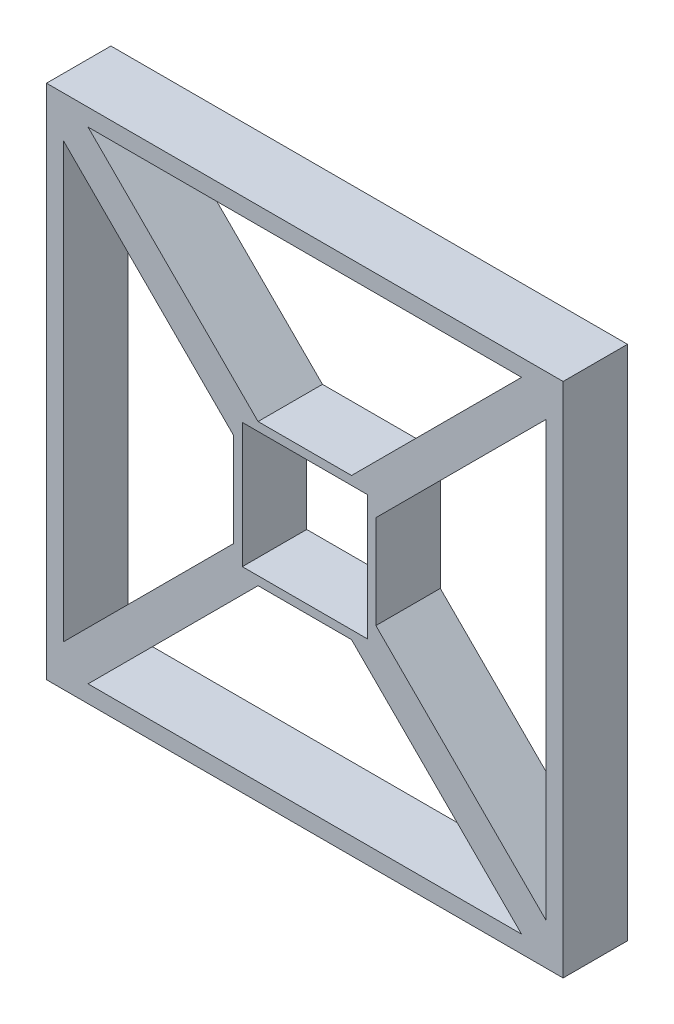
ISO-10303-21;
HEADER;
FILE_DESCRIPTION(('STEP AP214'),'2;1');
FILE_NAME('part.step','',(''),(''),'','','');
FILE_SCHEMA(('AUTOMOTIVE_DESIGN { 1 0 10303 214 1 1 1 1 }'));
ENDSEC;
DATA;
#1=APPLICATION_CONTEXT('core data for automotive mechanical design processes');
#2=APPLICATION_PROTOCOL_DEFINITION('international standard','automotive_design',2000,#1);
#3=PRODUCT_CONTEXT('',#1,'mechanical');
#4=PRODUCT('Part','Part','',(#3));
#5=PRODUCT_RELATED_PRODUCT_CATEGORY('part','',(#4));
#6=PRODUCT_DEFINITION_FORMATION('','',#4);
#7=PRODUCT_DEFINITION_CONTEXT('part definition',#1,'design');
#8=PRODUCT_DEFINITION('design','',#6,#7);
#9=PRODUCT_DEFINITION_SHAPE('','',#8);
#10=(LENGTH_UNIT() NAMED_UNIT(*) SI_UNIT(.MILLI.,.METRE.));
#11=(NAMED_UNIT(*) PLANE_ANGLE_UNIT() SI_UNIT($,.RADIAN.));
#12=(NAMED_UNIT(*) SI_UNIT($,.STERADIAN.) SOLID_ANGLE_UNIT());
#13=UNCERTAINTY_MEASURE_WITH_UNIT(LENGTH_MEASURE(1.E-05),#10,'distance_accuracy_value','');
#14=(GEOMETRIC_REPRESENTATION_CONTEXT(3) GLOBAL_UNCERTAINTY_ASSIGNED_CONTEXT((#13)) GLOBAL_UNIT_ASSIGNED_CONTEXT((#10,
#11,#12)) REPRESENTATION_CONTEXT('',''));
#15=CARTESIAN_POINT('',(0.,0.,0.));
#16=DIRECTION('',(0.,0.,1.));
#17=DIRECTION('',(1.,0.,0.));
#18=AXIS2_PLACEMENT_3D('',#15,#16,#17);
#19=CARTESIAN_POINT('',(0.,0.,748.));
#20=DIRECTION('',(0.,0.,-1.));
#21=DIRECTION('',(-1.,0.,0.));
#22=AXIS2_PLACEMENT_3D('',#19,#20,#21);
#23=PLANE('',#22);
#24=DIRECTION('',(0.707106781186548,-0.707106781186547,0.));
#25=VECTOR('',#24,1.);
#26=CARTESIAN_POINT('',(-2517.15728752538,2800.,748.));
#27=LINE('',#26,#25);
#28=CARTESIAN_POINT('',(-2517.15728752538,2800.,748.));
#29=VERTEX_POINT('',#28);
#30=CARTESIAN_POINT('',(-542.768436449289,825.611148923909,748.));
#31=VERTEX_POINT('',#30);
#32=EDGE_CURVE('E423',#29,#31,#27,.T.);
#33=ORIENTED_EDGE('',*,*,#32,.F.);
#34=DIRECTION('',(1.,0.,0.));
#35=VECTOR('',#34,1.);
#36=CARTESIAN_POINT('',(-2517.15728752538,2800.,748.));
#37=LINE('',#36,#35);
#38=CARTESIAN_POINT('',(2517.15728752538,2800.,748.));
#39=VERTEX_POINT('',#38);
#40=EDGE_CURVE('E418',#29,#39,#37,.T.);
#41=ORIENTED_EDGE('',*,*,#40,.T.);
#42=DIRECTION('',(0.707106781186547,0.707106781186547,0.));
#43=VECTOR('',#42,1.);
#44=CARTESIAN_POINT('',(542.768436449289,825.611148923909,748.));
#45=LINE('',#44,#43);
#46=CARTESIAN_POINT('',(542.768436449289,825.611148923909,748.));
#47=VERTEX_POINT('',#46);
#48=EDGE_CURVE('E410',#47,#39,#45,.T.);
#49=ORIENTED_EDGE('',*,*,#48,.F.);
#50=DIRECTION('',(1.,0.,0.));
#51=VECTOR('',#50,1.);
#52=CARTESIAN_POINT('',(-542.768436449289,825.611148923909,748.));
#53=LINE('',#52,#51);
#54=EDGE_CURVE('E417',#31,#47,#53,.T.);
#55=ORIENTED_EDGE('',*,*,#54,.F.);
#56=EDGE_LOOP('',(#33,#41,#49,#55));
#57=FACE_BOUND('',#56,.T.);
#58=DIRECTION('',(0.,-1.,0.));
#59=VECTOR('',#58,1.);
#60=CARTESIAN_POINT('',(-2800.,2517.15728752538,748.));
#61=LINE('',#60,#59);
#62=CARTESIAN_POINT('',(-2800.,2517.15728752538,748.));
#63=VERTEX_POINT('',#62);
#64=CARTESIAN_POINT('',(-2800.,-2517.15728752538,748.));
#65=VERTEX_POINT('',#64);
#66=EDGE_CURVE('E455',#63,#65,#61,.T.);
#67=ORIENTED_EDGE('',*,*,#66,.F.);
#68=DIRECTION('',(0.707106781186547,-0.707106781186548,0.));
#69=VECTOR('',#68,1.);
#70=CARTESIAN_POINT('',(-2800.,2517.15728752538,748.));
#71=LINE('',#70,#69);
#72=CARTESIAN_POINT('',(-825.611148923909,542.76843644929,748.));
#73=VERTEX_POINT('',#72);
#74=EDGE_CURVE('E445',#63,#73,#71,.T.);
#75=ORIENTED_EDGE('',*,*,#74,.T.);
#76=DIRECTION('',(0.,-1.,0.));
#77=VECTOR('',#76,1.);
#78=CARTESIAN_POINT('',(-825.611148923909,542.76843644929,748.));
#79=LINE('',#78,#77);
#80=CARTESIAN_POINT('',(-825.611148923908,-542.768436449287,748.));
#81=VERTEX_POINT('',#80);
#82=EDGE_CURVE('E448',#73,#81,#79,.T.);
#83=ORIENTED_EDGE('',*,*,#82,.T.);
#84=DIRECTION('',(0.707106781186547,0.707106781186548,0.));
#85=VECTOR('',#84,1.);
#86=CARTESIAN_POINT('',(-2800.,-2517.15728752538,748.));
#87=LINE('',#86,#85);
#88=EDGE_CURVE('E452',#65,#81,#87,.T.);
#89=ORIENTED_EDGE('',*,*,#88,.F.);
#90=EDGE_LOOP('',(#67,#75,#83,#89));
#91=FACE_BOUND('',#90,.T.);
#92=DIRECTION('',(1.,0.,0.));
#93=VECTOR('',#92,1.);
#94=CARTESIAN_POINT('',(-3000.,3000.,748.));
#95=LINE('',#94,#93);
#96=CARTESIAN_POINT('',(-3000.,3000.,748.));
#97=VERTEX_POINT('',#96);
#98=CARTESIAN_POINT('',(3000.,3000.,748.));
#99=VERTEX_POINT('',#98);
#100=EDGE_CURVE('E571',#97,#99,#95,.T.);
#101=ORIENTED_EDGE('',*,*,#100,.F.);
#102=DIRECTION('',(0.,-1.,0.));
#103=VECTOR('',#102,1.);
#104=CARTESIAN_POINT('',(-3000.,3000.,748.));
#105=LINE('',#104,#103);
#106=CARTESIAN_POINT('',(-3000.,-3000.,748.));
#107=VERTEX_POINT('',#106);
#108=EDGE_CURVE('E580',#97,#107,#105,.T.);
#109=ORIENTED_EDGE('',*,*,#108,.T.);
#110=DIRECTION('',(1.,0.,0.));
#111=VECTOR('',#110,1.);
#112=CARTESIAN_POINT('',(-3000.,-3000.,748.));
#113=LINE('',#112,#111);
#114=CARTESIAN_POINT('',(3000.,-3000.,748.));
#115=VERTEX_POINT('',#114);
#116=EDGE_CURVE('E578',#107,#115,#113,.T.);
#117=ORIENTED_EDGE('',*,*,#116,.T.);
#118=DIRECTION('',(0.,-1.,0.));
#119=VECTOR('',#118,1.);
#120=CARTESIAN_POINT('',(3000.,3000.,748.));
#121=LINE('',#120,#119);
#122=EDGE_CURVE('E574',#99,#115,#121,.T.);
#123=ORIENTED_EDGE('',*,*,#122,.F.);
#124=EDGE_LOOP('',(#101,#109,#117,#123));
#125=FACE_BOUND('',#124,.T.);
#126=DIRECTION('',(0.707106781186547,0.707106781186548,0.));
#127=VECTOR('',#126,1.);
#128=CARTESIAN_POINT('',(-2517.15728752538,-2800.,748.));
#129=LINE('',#128,#127);
#130=CARTESIAN_POINT('',(-2517.15728752538,-2800.,748.));
#131=VERTEX_POINT('',#130);
#132=CARTESIAN_POINT('',(-542.768436449289,-825.611148923907,748.));
#133=VERTEX_POINT('',#132);
#134=EDGE_CURVE('E549',#131,#133,#129,.T.);
#135=ORIENTED_EDGE('',*,*,#134,.T.);
#136=DIRECTION('',(1.,0.,0.));
#137=VECTOR('',#136,1.);
#138=CARTESIAN_POINT('',(-542.768436449289,-825.611148923907,748.));
#139=LINE('',#138,#137);
#140=CARTESIAN_POINT('',(542.768436449287,-825.611148923907,748.));
#141=VERTEX_POINT('',#140);
#142=EDGE_CURVE('E539',#133,#141,#139,.T.);
#143=ORIENTED_EDGE('',*,*,#142,.T.);
#144=DIRECTION('',(0.707106781186548,-0.707106781186547,0.));
#145=VECTOR('',#144,1.);
#146=CARTESIAN_POINT('',(542.768436449287,-825.611148923907,748.));
#147=LINE('',#146,#145);
#148=CARTESIAN_POINT('',(2517.15728752538,-2800.,748.));
#149=VERTEX_POINT('',#148);
#150=EDGE_CURVE('E542',#141,#149,#147,.T.);
#151=ORIENTED_EDGE('',*,*,#150,.T.);
#152=DIRECTION('',(1.,0.,0.));
#153=VECTOR('',#152,1.);
#154=CARTESIAN_POINT('',(-2517.15728752538,-2800.,748.));
#155=LINE('',#154,#153);
#156=EDGE_CURVE('E546',#131,#149,#155,.T.);
#157=ORIENTED_EDGE('',*,*,#156,.F.);
#158=EDGE_LOOP('',(#135,#143,#151,#157));
#159=FACE_BOUND('',#158,.T.);
#160=DIRECTION('',(0.,-1.,0.));
#161=VECTOR('',#160,1.);
#162=CARTESIAN_POINT('',(-725.611148923909,725.611148923909,748.));
#163=LINE('',#162,#161);
#164=CARTESIAN_POINT('',(-725.611148923909,725.611148923909,748.));
#165=VERTEX_POINT('',#164);
#166=CARTESIAN_POINT('',(-725.611148923909,-725.611148923907,748.));
#167=VERTEX_POINT('',#166);
#168=EDGE_CURVE('E518',#165,#167,#163,.T.);
#169=ORIENTED_EDGE('',*,*,#168,.F.);
#170=DIRECTION('',(1.,0.,0.));
#171=VECTOR('',#170,1.);
#172=CARTESIAN_POINT('',(-725.611148923909,725.611148923909,748.));
#173=LINE('',#172,#171);
#174=CARTESIAN_POINT('',(725.611148923909,725.611148923909,748.));
#175=VERTEX_POINT('',#174);
#176=EDGE_CURVE('E508',#165,#175,#173,.T.);
#177=ORIENTED_EDGE('',*,*,#176,.T.);
#178=DIRECTION('',(0.,-1.,0.));
#179=VECTOR('',#178,1.);
#180=CARTESIAN_POINT('',(725.611148923909,725.611148923909,748.));
#181=LINE('',#180,#179);
#182=CARTESIAN_POINT('',(725.611148923909,-725.611148923907,748.));
#183=VERTEX_POINT('',#182);
#184=EDGE_CURVE('E511',#175,#183,#181,.T.);
#185=ORIENTED_EDGE('',*,*,#184,.T.);
#186=DIRECTION('',(1.,0.,0.));
#187=VECTOR('',#186,1.);
#188=CARTESIAN_POINT('',(-725.611148923909,-725.611148923907,748.));
#189=LINE('',#188,#187);
#190=EDGE_CURVE('E515',#167,#183,#189,.T.);
#191=ORIENTED_EDGE('',*,*,#190,.F.);
#192=EDGE_LOOP('',(#169,#177,#185,#191));
#193=FACE_BOUND('',#192,.T.);
#194=DIRECTION('',(0.,-1.,0.));
#195=VECTOR('',#194,1.);
#196=CARTESIAN_POINT('',(825.611148923909,542.76843644929,748.));
#197=LINE('',#196,#195);
#198=CARTESIAN_POINT('',(825.611148923909,542.76843644929,748.));
#199=VERTEX_POINT('',#198);
#200=CARTESIAN_POINT('',(825.611148923908,-542.768436449288,748.));
#201=VERTEX_POINT('',#200);
#202=EDGE_CURVE('E476',#199,#201,#197,.T.);
#203=ORIENTED_EDGE('',*,*,#202,.F.);
#204=DIRECTION('',(0.707106781186548,0.707106781186547,0.));
#205=VECTOR('',#204,1.);
#206=CARTESIAN_POINT('',(825.611148923909,542.76843644929,748.));
#207=LINE('',#206,#205);
#208=CARTESIAN_POINT('',(2800.,2517.15728752538,748.));
#209=VERTEX_POINT('',#208);
#210=EDGE_CURVE('E484',#199,#209,#207,.T.);
#211=ORIENTED_EDGE('',*,*,#210,.T.);
#212=DIRECTION('',(0.,-1.,0.));
#213=VECTOR('',#212,1.);
#214=CARTESIAN_POINT('',(2800.,2517.15728752538,748.));
#215=LINE('',#214,#213);
#216=CARTESIAN_POINT('',(2800.,-2517.15728752538,748.));
#217=VERTEX_POINT('',#216);
#218=EDGE_CURVE('E481',#209,#217,#215,.T.);
#219=ORIENTED_EDGE('',*,*,#218,.T.);
#220=DIRECTION('',(0.707106781186548,-0.707106781186547,0.));
#221=VECTOR('',#220,1.);
#222=CARTESIAN_POINT('',(825.611148923908,-542.768436449288,748.));
#223=LINE('',#222,#221);
#224=EDGE_CURVE('E478',#201,#217,#223,.T.);
#225=ORIENTED_EDGE('',*,*,#224,.F.);
#226=EDGE_LOOP('',(#203,#211,#219,#225));
#227=FACE_BOUND('',#226,.T.);
#228=ADVANCED_FACE('F249',(#57,#91,#125,#159,#193,#227),#23,.F.);
#229=CARTESIAN_POINT('',(0.,0.,0.));
#230=DIRECTION('',(0.,0.,-1.));
#231=DIRECTION('',(-1.,0.,0.));
#232=AXIS2_PLACEMENT_3D('',#229,#230,#231);
#233=PLANE('',#232);
#234=DIRECTION('',(1.,0.,0.));
#235=VECTOR('',#234,1.);
#236=CARTESIAN_POINT('',(-2517.15728752538,2800.,0.));
#237=LINE('',#236,#235);
#238=CARTESIAN_POINT('',(-2517.15728752538,2800.,0.));
#239=VERTEX_POINT('',#238);
#240=CARTESIAN_POINT('',(2517.15728752538,2800.,0.));
#241=VERTEX_POINT('',#240);
#242=EDGE_CURVE('E274',#239,#241,#237,.T.);
#243=ORIENTED_EDGE('',*,*,#242,.F.);
#244=DIRECTION('',(0.707106781186548,-0.707106781186547,0.));
#245=VECTOR('',#244,1.);
#246=CARTESIAN_POINT('',(-2517.15728752538,2800.,0.));
#247=LINE('',#246,#245);
#248=CARTESIAN_POINT('',(-542.768436449289,825.611148923909,0.));
#249=VERTEX_POINT('',#248);
#250=EDGE_CURVE('E426',#239,#249,#247,.T.);
#251=ORIENTED_EDGE('',*,*,#250,.T.);
#252=DIRECTION('',(1.,0.,0.));
#253=VECTOR('',#252,1.);
#254=CARTESIAN_POINT('',(-542.768436449289,825.611148923909,0.));
#255=LINE('',#254,#253);
#256=CARTESIAN_POINT('',(542.768436449289,825.611148923909,0.));
#257=VERTEX_POINT('',#256);
#258=EDGE_CURVE('E429',#249,#257,#255,.T.);
#259=ORIENTED_EDGE('',*,*,#258,.T.);
#260=DIRECTION('',(0.707106781186547,0.707106781186547,0.));
#261=VECTOR('',#260,1.);
#262=CARTESIAN_POINT('',(542.768436449289,825.611148923909,0.));
#263=LINE('',#262,#261);
#264=EDGE_CURVE('E435',#257,#241,#263,.T.);
#265=ORIENTED_EDGE('',*,*,#264,.T.);
#266=EDGE_LOOP('',(#243,#251,#259,#265));
#267=FACE_BOUND('',#266,.T.);
#268=DIRECTION('',(0.707106781186547,-0.707106781186548,0.));
#269=VECTOR('',#268,1.);
#270=CARTESIAN_POINT('',(-2800.,2517.15728752538,0.));
#271=LINE('',#270,#269);
#272=CARTESIAN_POINT('',(-2800.,2517.15728752538,0.));
#273=VERTEX_POINT('',#272);
#274=CARTESIAN_POINT('',(-825.611148923909,542.76843644929,0.));
#275=VERTEX_POINT('',#274);
#276=EDGE_CURVE('E441',#273,#275,#271,.T.);
#277=ORIENTED_EDGE('',*,*,#276,.F.);
#278=DIRECTION('',(0.,-1.,0.));
#279=VECTOR('',#278,1.);
#280=CARTESIAN_POINT('',(-2800.,2517.15728752538,0.));
#281=LINE('',#280,#279);
#282=CARTESIAN_POINT('',(-2800.,-2517.15728752538,0.));
#283=VERTEX_POINT('',#282);
#284=EDGE_CURVE('E449',#273,#283,#281,.T.);
#285=ORIENTED_EDGE('',*,*,#284,.T.);
#286=DIRECTION('',(0.707106781186547,0.707106781186548,0.));
#287=VECTOR('',#286,1.);
#288=CARTESIAN_POINT('',(-2800.,-2517.15728752538,0.));
#289=LINE('',#288,#287);
#290=CARTESIAN_POINT('',(-825.611148923908,-542.768436449287,0.));
#291=VERTEX_POINT('',#290);
#292=EDGE_CURVE('E462',#283,#291,#289,.T.);
#293=ORIENTED_EDGE('',*,*,#292,.T.);
#294=DIRECTION('',(0.,-1.,0.));
#295=VECTOR('',#294,1.);
#296=CARTESIAN_POINT('',(-825.611148923909,542.76843644929,0.));
#297=LINE('',#296,#295);
#298=EDGE_CURVE('E459',#275,#291,#297,.T.);
#299=ORIENTED_EDGE('',*,*,#298,.F.);
#300=EDGE_LOOP('',(#277,#285,#293,#299));
#301=FACE_BOUND('',#300,.T.);
#302=DIRECTION('',(1.,0.,0.));
#303=VECTOR('',#302,1.);
#304=CARTESIAN_POINT('',(-725.611148923909,725.611148923909,0.));
#305=LINE('',#304,#303);
#306=CARTESIAN_POINT('',(-725.611148923909,725.611148923909,0.));
#307=VERTEX_POINT('',#306);
#308=CARTESIAN_POINT('',(725.611148923909,725.611148923909,0.));
#309=VERTEX_POINT('',#308);
#310=EDGE_CURVE('E507',#307,#309,#305,.T.);
#311=ORIENTED_EDGE('',*,*,#310,.F.);
#312=DIRECTION('',(0.,-1.,0.));
#313=VECTOR('',#312,1.);
#314=CARTESIAN_POINT('',(-725.611148923909,725.611148923909,0.));
#315=LINE('',#314,#313);
#316=CARTESIAN_POINT('',(-725.611148923909,-725.611148923907,0.));
#317=VERTEX_POINT('',#316);
#318=EDGE_CURVE('E512',#307,#317,#315,.T.);
#319=ORIENTED_EDGE('',*,*,#318,.T.);
#320=DIRECTION('',(1.,0.,0.));
#321=VECTOR('',#320,1.);
#322=CARTESIAN_POINT('',(-725.611148923909,-725.611148923907,0.));
#323=LINE('',#322,#321);
#324=CARTESIAN_POINT('',(725.611148923909,-725.611148923907,0.));
#325=VERTEX_POINT('',#324);
#326=EDGE_CURVE('E525',#317,#325,#323,.T.);
#327=ORIENTED_EDGE('',*,*,#326,.T.);
#328=DIRECTION('',(0.,-1.,0.));
#329=VECTOR('',#328,1.);
#330=CARTESIAN_POINT('',(725.611148923909,725.611148923909,0.));
#331=LINE('',#330,#329);
#332=EDGE_CURVE('E522',#309,#325,#331,.T.);
#333=ORIENTED_EDGE('',*,*,#332,.F.);
#334=EDGE_LOOP('',(#311,#319,#327,#333));
#335=FACE_BOUND('',#334,.T.);
#336=DIRECTION('',(1.,0.,0.));
#337=VECTOR('',#336,1.);
#338=CARTESIAN_POINT('',(-542.768436449289,-825.611148923907,0.));
#339=LINE('',#338,#337);
#340=CARTESIAN_POINT('',(-542.768436449289,-825.611148923907,0.));
#341=VERTEX_POINT('',#340);
#342=CARTESIAN_POINT('',(542.768436449287,-825.611148923907,0.));
#343=VERTEX_POINT('',#342);
#344=EDGE_CURVE('E532',#341,#343,#339,.T.);
#345=ORIENTED_EDGE('',*,*,#344,.F.);
#346=DIRECTION('',(0.707106781186547,0.707106781186548,0.));
#347=VECTOR('',#346,1.);
#348=CARTESIAN_POINT('',(-2517.15728752538,-2800.,0.));
#349=LINE('',#348,#347);
#350=CARTESIAN_POINT('',(-2517.15728752538,-2800.,0.));
#351=VERTEX_POINT('',#350);
#352=EDGE_CURVE('E543',#351,#341,#349,.T.);
#353=ORIENTED_EDGE('',*,*,#352,.F.);
#354=DIRECTION('',(1.,0.,0.));
#355=VECTOR('',#354,1.);
#356=CARTESIAN_POINT('',(-2517.15728752538,-2800.,0.));
#357=LINE('',#356,#355);
#358=CARTESIAN_POINT('',(2517.15728752538,-2800.,0.));
#359=VERTEX_POINT('',#358);
#360=EDGE_CURVE('E557',#351,#359,#357,.T.);
#361=ORIENTED_EDGE('',*,*,#360,.T.);
#362=DIRECTION('',(0.707106781186548,-0.707106781186547,0.));
#363=VECTOR('',#362,1.);
#364=CARTESIAN_POINT('',(542.768436449287,-825.611148923907,0.));
#365=LINE('',#364,#363);
#366=EDGE_CURVE('E554',#343,#359,#365,.T.);
#367=ORIENTED_EDGE('',*,*,#366,.F.);
#368=EDGE_LOOP('',(#345,#353,#361,#367));
#369=FACE_BOUND('',#368,.T.);
#370=DIRECTION('',(1.,0.,0.));
#371=VECTOR('',#370,1.);
#372=CARTESIAN_POINT('',(-3000.,3000.,0.));
#373=LINE('',#372,#371);
#374=CARTESIAN_POINT('',(-3000.,3000.,0.));
#375=VERTEX_POINT('',#374);
#376=CARTESIAN_POINT('',(3000.,3000.,0.));
#377=VERTEX_POINT('',#376);
#378=EDGE_CURVE('E564',#375,#377,#373,.T.);
#379=ORIENTED_EDGE('',*,*,#378,.T.);
#380=DIRECTION('',(0.,-1.,0.));
#381=VECTOR('',#380,1.);
#382=CARTESIAN_POINT('',(3000.,3000.,0.));
#383=LINE('',#382,#381);
#384=CARTESIAN_POINT('',(3000.,-3000.,0.));
#385=VERTEX_POINT('',#384);
#386=EDGE_CURVE('E584',#377,#385,#383,.T.);
#387=ORIENTED_EDGE('',*,*,#386,.T.);
#388=DIRECTION('',(1.,0.,0.));
#389=VECTOR('',#388,1.);
#390=CARTESIAN_POINT('',(-3000.,-3000.,0.));
#391=LINE('',#390,#389);
#392=CARTESIAN_POINT('',(-3000.,-3000.,0.));
#393=VERTEX_POINT('',#392);
#394=EDGE_CURVE('E587',#393,#385,#391,.T.);
#395=ORIENTED_EDGE('',*,*,#394,.F.);
#396=DIRECTION('',(0.,-1.,0.));
#397=VECTOR('',#396,1.);
#398=CARTESIAN_POINT('',(-3000.,3000.,0.));
#399=LINE('',#398,#397);
#400=EDGE_CURVE('E575',#375,#393,#399,.T.);
#401=ORIENTED_EDGE('',*,*,#400,.F.);
#402=EDGE_LOOP('',(#379,#387,#395,#401));
#403=FACE_BOUND('',#402,.T.);
#404=DIRECTION('',(0.707106781186548,0.707106781186547,0.));
#405=VECTOR('',#404,1.);
#406=CARTESIAN_POINT('',(825.611148923909,542.76843644929,0.));
#407=LINE('',#406,#405);
#408=CARTESIAN_POINT('',(825.611148923909,542.76843644929,0.));
#409=VERTEX_POINT('',#408);
#410=CARTESIAN_POINT('',(2800.,2517.15728752538,0.));
#411=VERTEX_POINT('',#410);
#412=EDGE_CURVE('E479',#409,#411,#407,.T.);
#413=ORIENTED_EDGE('',*,*,#412,.F.);
#414=DIRECTION('',(0.,-1.,0.));
#415=VECTOR('',#414,1.);
#416=CARTESIAN_POINT('',(825.611148923909,542.76843644929,0.));
#417=LINE('',#416,#415);
#418=CARTESIAN_POINT('',(825.611148923908,-542.768436449288,0.));
#419=VERTEX_POINT('',#418);
#420=EDGE_CURVE('E469',#409,#419,#417,.T.);
#421=ORIENTED_EDGE('',*,*,#420,.T.);
#422=DIRECTION('',(0.707106781186548,-0.707106781186547,0.));
#423=VECTOR('',#422,1.);
#424=CARTESIAN_POINT('',(825.611148923908,-542.768436449288,0.));
#425=LINE('',#424,#423);
#426=CARTESIAN_POINT('',(2800.,-2517.15728752538,0.));
#427=VERTEX_POINT('',#426);
#428=EDGE_CURVE('E490',#419,#427,#425,.T.);
#429=ORIENTED_EDGE('',*,*,#428,.T.);
#430=DIRECTION('',(0.,-1.,0.));
#431=VECTOR('',#430,1.);
#432=CARTESIAN_POINT('',(2800.,2517.15728752538,0.));
#433=LINE('',#432,#431);
#434=EDGE_CURVE('E493',#411,#427,#433,.T.);
#435=ORIENTED_EDGE('',*,*,#434,.F.);
#436=EDGE_LOOP('',(#413,#421,#429,#435));
#437=FACE_BOUND('',#436,.T.);
#438=ADVANCED_FACE('F604',(#267,#301,#335,#369,#403,#437),#233,.T.);
#439=CARTESIAN_POINT('',(-3000.,3000.,748.));
#440=DIRECTION('',(0.,1.,0.));
#441=DIRECTION('',(0.,0.,1.));
#442=AXIS2_PLACEMENT_3D('',#439,#440,#441);
#443=PLANE('',#442);
#444=ORIENTED_EDGE('',*,*,#378,.F.);
#445=DIRECTION('',(0.,0.,-1.));
#446=VECTOR('',#445,1.);
#447=CARTESIAN_POINT('',(-3000.,3000.,748.));
#448=LINE('',#447,#446);
#449=EDGE_CURVE('E12',#97,#375,#448,.T.);
#450=ORIENTED_EDGE('',*,*,#449,.F.);
#451=ORIENTED_EDGE('',*,*,#100,.T.);
#452=DIRECTION('',(0.,0.,-1.));
#453=VECTOR('',#452,1.);
#454=CARTESIAN_POINT('',(3000.,3000.,748.));
#455=LINE('',#454,#453);
#456=EDGE_CURVE('E253',#99,#377,#455,.T.);
#457=ORIENTED_EDGE('',*,*,#456,.T.);
#458=EDGE_LOOP('',(#444,#450,#451,#457));
#459=FACE_BOUND('',#458,.T.);
#460=ADVANCED_FACE('F251',(#459),#443,.T.);
#461=CARTESIAN_POINT('',(-3000.,3000.,748.));
#462=DIRECTION('',(1.,0.,0.));
#463=DIRECTION('',(0.,1.,0.));
#464=AXIS2_PLACEMENT_3D('',#461,#462,#463);
#465=PLANE('',#464);
#466=ORIENTED_EDGE('',*,*,#400,.T.);
#467=DIRECTION('',(0.,0.,-1.));
#468=VECTOR('',#467,1.);
#469=CARTESIAN_POINT('',(-3000.,-3000.,748.));
#470=LINE('',#469,#468);
#471=EDGE_CURVE('E258',#107,#393,#470,.T.);
#472=ORIENTED_EDGE('',*,*,#471,.F.);
#473=ORIENTED_EDGE('',*,*,#108,.F.);
#474=ORIENTED_EDGE('',*,*,#449,.T.);
#475=EDGE_LOOP('',(#466,#472,#473,#474));
#476=FACE_BOUND('',#475,.T.);
#477=ADVANCED_FACE('F608',(#476),#465,.F.);
#478=CARTESIAN_POINT('',(-3000.,-3000.,748.));
#479=DIRECTION('',(0.,1.,0.));
#480=DIRECTION('',(0.,0.,1.));
#481=AXIS2_PLACEMENT_3D('',#478,#479,#480);
#482=PLANE('',#481);
#483=ORIENTED_EDGE('',*,*,#394,.T.);
#484=DIRECTION('',(0.,0.,-1.));
#485=VECTOR('',#484,1.);
#486=CARTESIAN_POINT('',(3000.,-3000.,748.));
#487=LINE('',#486,#485);
#488=EDGE_CURVE('E592',#115,#385,#487,.T.);
#489=ORIENTED_EDGE('',*,*,#488,.F.);
#490=ORIENTED_EDGE('',*,*,#116,.F.);
#491=ORIENTED_EDGE('',*,*,#471,.T.);
#492=EDGE_LOOP('',(#483,#489,#490,#491));
#493=FACE_BOUND('',#492,.T.);
#494=ADVANCED_FACE('F612',(#493),#482,.F.);
#495=CARTESIAN_POINT('',(3000.,3000.,748.));
#496=DIRECTION('',(1.,0.,0.));
#497=DIRECTION('',(0.,1.,0.));
#498=AXIS2_PLACEMENT_3D('',#495,#496,#497);
#499=PLANE('',#498);
#500=ORIENTED_EDGE('',*,*,#386,.F.);
#501=ORIENTED_EDGE('',*,*,#456,.F.);
#502=ORIENTED_EDGE('',*,*,#122,.T.);
#503=ORIENTED_EDGE('',*,*,#488,.T.);
#504=EDGE_LOOP('',(#500,#501,#502,#503));
#505=FACE_BOUND('',#504,.T.);
#506=ADVANCED_FACE('F600',(#505),#499,.T.);
#507=CARTESIAN_POINT('',(-542.768436449289,-825.611148923907,748.));
#508=DIRECTION('',(0.,1.,0.));
#509=DIRECTION('',(-1.,0.,0.));
#510=AXIS2_PLACEMENT_3D('',#507,#508,#509);
#511=PLANE('',#510);
#512=ORIENTED_EDGE('',*,*,#344,.T.);
#513=DIRECTION('',(0.,0.,-1.));
#514=VECTOR('',#513,1.);
#515=CARTESIAN_POINT('',(542.768436449287,-825.611148923907,748.));
#516=LINE('',#515,#514);
#517=EDGE_CURVE('E552',#141,#343,#516,.T.);
#518=ORIENTED_EDGE('',*,*,#517,.F.);
#519=ORIENTED_EDGE('',*,*,#142,.F.);
#520=DIRECTION('',(0.,0.,-1.));
#521=VECTOR('',#520,1.);
#522=CARTESIAN_POINT('',(-542.768436449289,-825.611148923907,748.));
#523=LINE('',#522,#521);
#524=EDGE_CURVE('E562',#133,#341,#523,.T.);
#525=ORIENTED_EDGE('',*,*,#524,.T.);
#526=EDGE_LOOP('',(#512,#518,#519,#525));
#527=FACE_BOUND('',#526,.T.);
#528=ADVANCED_FACE('F673',(#527),#511,.F.);
#529=CARTESIAN_POINT('',(-2517.15728752538,-2800.,748.));
#530=DIRECTION('',(-0.707106781186548,0.707106781186547,0.));
#531=DIRECTION('',(-0.707106781186547,-0.707106781186548,0.));
#532=AXIS2_PLACEMENT_3D('',#529,#530,#531);
#533=PLANE('',#532);
#534=ORIENTED_EDGE('',*,*,#352,.T.);
#535=ORIENTED_EDGE('',*,*,#524,.F.);
#536=ORIENTED_EDGE('',*,*,#134,.F.);
#537=DIRECTION('',(0.,0.,-1.));
#538=VECTOR('',#537,1.);
#539=CARTESIAN_POINT('',(-2517.15728752538,-2800.,748.));
#540=LINE('',#539,#538);
#541=EDGE_CURVE('E565',#131,#351,#540,.T.);
#542=ORIENTED_EDGE('',*,*,#541,.T.);
#543=EDGE_LOOP('',(#534,#535,#536,#542));
#544=FACE_BOUND('',#543,.T.);
#545=ADVANCED_FACE('F669',(#544),#533,.F.);
#546=CARTESIAN_POINT('',(-2517.15728752538,-2800.,748.));
#547=DIRECTION('',(0.,1.,0.));
#548=DIRECTION('',(0.,0.,1.));
#549=AXIS2_PLACEMENT_3D('',#546,#547,#548);
#550=PLANE('',#549);
#551=ORIENTED_EDGE('',*,*,#360,.F.);
#552=ORIENTED_EDGE('',*,*,#541,.F.);
#553=ORIENTED_EDGE('',*,*,#156,.T.);
#554=DIRECTION('',(0.,0.,-1.));
#555=VECTOR('',#554,1.);
#556=CARTESIAN_POINT('',(2517.15728752538,-2800.,748.));
#557=LINE('',#556,#555);
#558=EDGE_CURVE('E567',#149,#359,#557,.T.);
#559=ORIENTED_EDGE('',*,*,#558,.T.);
#560=EDGE_LOOP('',(#551,#552,#553,#559));
#561=FACE_BOUND('',#560,.T.);
#562=ADVANCED_FACE('F672',(#561),#550,.T.);
#563=CARTESIAN_POINT('',(542.768436449287,-825.611148923907,748.));
#564=DIRECTION('',(0.707106781186548,0.707106781186548,0.));
#565=DIRECTION('',(-0.707106781186548,0.707106781186547,0.));
#566=AXIS2_PLACEMENT_3D('',#563,#564,#565);
#567=PLANE('',#566);
#568=ORIENTED_EDGE('',*,*,#366,.T.);
#569=ORIENTED_EDGE('',*,*,#558,.F.);
#570=ORIENTED_EDGE('',*,*,#150,.F.);
#571=ORIENTED_EDGE('',*,*,#517,.T.);
#572=EDGE_LOOP('',(#568,#569,#570,#571));
#573=FACE_BOUND('',#572,.T.);
#574=ADVANCED_FACE('F667',(#573),#567,.F.);
#575=CARTESIAN_POINT('',(-725.611148923909,725.611148923909,748.));
#576=DIRECTION('',(0.,1.,0.));
#577=DIRECTION('',(0.,0.,1.));
#578=AXIS2_PLACEMENT_3D('',#575,#576,#577);
#579=PLANE('',#578);
#580=ORIENTED_EDGE('',*,*,#310,.T.);
#581=DIRECTION('',(0.,0.,-1.));
#582=VECTOR('',#581,1.);
#583=CARTESIAN_POINT('',(725.611148923909,725.611148923909,748.));
#584=LINE('',#583,#582);
#585=EDGE_CURVE('E520',#175,#309,#584,.T.);
#586=ORIENTED_EDGE('',*,*,#585,.F.);
#587=ORIENTED_EDGE('',*,*,#176,.F.);
#588=DIRECTION('',(0.,0.,-1.));
#589=VECTOR('',#588,1.);
#590=CARTESIAN_POINT('',(-725.611148923909,725.611148923909,748.));
#591=LINE('',#590,#589);
#592=EDGE_CURVE('E530',#165,#307,#591,.T.);
#593=ORIENTED_EDGE('',*,*,#592,.T.);
#594=EDGE_LOOP('',(#580,#586,#587,#593));
#595=FACE_BOUND('',#594,.T.);
#596=ADVANCED_FACE('F657',(#595),#579,.F.);
#597=CARTESIAN_POINT('',(-725.611148923909,725.611148923909,748.));
#598=DIRECTION('',(1.,0.,0.));
#599=DIRECTION('',(0.,0.,-1.));
#600=AXIS2_PLACEMENT_3D('',#597,#598,#599);
#601=PLANE('',#600);
#602=ORIENTED_EDGE('',*,*,#318,.F.);
#603=ORIENTED_EDGE('',*,*,#592,.F.);
#604=ORIENTED_EDGE('',*,*,#168,.T.);
#605=DIRECTION('',(0.,0.,-1.));
#606=VECTOR('',#605,1.);
#607=CARTESIAN_POINT('',(-725.611148923909,-725.611148923907,748.));
#608=LINE('',#607,#606);
#609=EDGE_CURVE('E533',#167,#317,#608,.T.);
#610=ORIENTED_EDGE('',*,*,#609,.T.);
#611=EDGE_LOOP('',(#602,#603,#604,#610));
#612=FACE_BOUND('',#611,.T.);
#613=ADVANCED_FACE('F653',(#612),#601,.T.);
#614=CARTESIAN_POINT('',(-725.611148923909,-725.611148923907,748.));
#615=DIRECTION('',(0.,1.,0.));
#616=DIRECTION('',(0.,0.,1.));
#617=AXIS2_PLACEMENT_3D('',#614,#615,#616);
#618=PLANE('',#617);
#619=ORIENTED_EDGE('',*,*,#326,.F.);
#620=ORIENTED_EDGE('',*,*,#609,.F.);
#621=ORIENTED_EDGE('',*,*,#190,.T.);
#622=DIRECTION('',(0.,0.,-1.));
#623=VECTOR('',#622,1.);
#624=CARTESIAN_POINT('',(725.611148923909,-725.611148923907,748.));
#625=LINE('',#624,#623);
#626=EDGE_CURVE('E535',#183,#325,#625,.T.);
#627=ORIENTED_EDGE('',*,*,#626,.T.);
#628=EDGE_LOOP('',(#619,#620,#621,#627));
#629=FACE_BOUND('',#628,.T.);
#630=ADVANCED_FACE('F656',(#629),#618,.T.);
#631=CARTESIAN_POINT('',(725.611148923909,725.611148923909,748.));
#632=DIRECTION('',(1.,0.,0.));
#633=DIRECTION('',(0.,0.,-1.));
#634=AXIS2_PLACEMENT_3D('',#631,#632,#633);
#635=PLANE('',#634);
#636=ORIENTED_EDGE('',*,*,#332,.T.);
#637=ORIENTED_EDGE('',*,*,#626,.F.);
#638=ORIENTED_EDGE('',*,*,#184,.F.);
#639=ORIENTED_EDGE('',*,*,#585,.T.);
#640=EDGE_LOOP('',(#636,#637,#638,#639));
#641=FACE_BOUND('',#640,.T.);
#642=ADVANCED_FACE('F652',(#641),#635,.F.);
#643=CARTESIAN_POINT('',(825.611148923909,542.76843644929,748.));
#644=DIRECTION('',(1.,0.,0.));
#645=DIRECTION('',(0.,1.,0.));
#646=AXIS2_PLACEMENT_3D('',#643,#644,#645);
#647=PLANE('',#646);
#648=ORIENTED_EDGE('',*,*,#420,.F.);
#649=DIRECTION('',(0.,0.,-1.));
#650=VECTOR('',#649,1.);
#651=CARTESIAN_POINT('',(825.611148923909,542.76843644929,748.));
#652=LINE('',#651,#650);
#653=EDGE_CURVE('E487',#199,#409,#652,.T.);
#654=ORIENTED_EDGE('',*,*,#653,.F.);
#655=ORIENTED_EDGE('',*,*,#202,.T.);
#656=DIRECTION('',(0.,0.,-1.));
#657=VECTOR('',#656,1.);
#658=CARTESIAN_POINT('',(825.611148923908,-542.768436449288,748.));
#659=LINE('',#658,#657);
#660=EDGE_CURVE('E504',#201,#419,#659,.T.);
#661=ORIENTED_EDGE('',*,*,#660,.T.);
#662=EDGE_LOOP('',(#648,#654,#655,#661));
#663=FACE_BOUND('',#662,.T.);
#664=ADVANCED_FACE('F628',(#663),#647,.T.);
#665=CARTESIAN_POINT('',(825.611148923908,-542.768436449288,748.));
#666=DIRECTION('',(0.707106781186548,0.707106781186548,0.));
#667=DIRECTION('',(-0.707106781186548,0.707106781186547,0.));
#668=AXIS2_PLACEMENT_3D('',#665,#666,#667);
#669=PLANE('',#668);
#670=ORIENTED_EDGE('',*,*,#428,.F.);
#671=ORIENTED_EDGE('',*,*,#660,.F.);
#672=ORIENTED_EDGE('',*,*,#224,.T.);
#673=DIRECTION('',(0.,0.,-1.));
#674=VECTOR('',#673,1.);
#675=CARTESIAN_POINT('',(2800.,-2517.15728752538,748.));
#676=LINE('',#675,#674);
#677=EDGE_CURVE('E502',#217,#427,#676,.T.);
#678=ORIENTED_EDGE('',*,*,#677,.T.);
#679=EDGE_LOOP('',(#670,#671,#672,#678));
#680=FACE_BOUND('',#679,.T.);
#681=ADVANCED_FACE('F630',(#680),#669,.T.);
#682=CARTESIAN_POINT('',(2800.,2517.15728752538,748.));
#683=DIRECTION('',(1.,0.,0.));
#684=DIRECTION('',(0.,0.,-1.));
#685=AXIS2_PLACEMENT_3D('',#682,#683,#684);
#686=PLANE('',#685);
#687=ORIENTED_EDGE('',*,*,#434,.T.);
#688=ORIENTED_EDGE('',*,*,#677,.F.);
#689=ORIENTED_EDGE('',*,*,#218,.F.);
#690=DIRECTION('',(0.,0.,-1.));
#691=VECTOR('',#690,1.);
#692=CARTESIAN_POINT('',(2800.,2517.15728752538,748.));
#693=LINE('',#692,#691);
#694=EDGE_CURVE('E500',#209,#411,#693,.T.);
#695=ORIENTED_EDGE('',*,*,#694,.T.);
#696=EDGE_LOOP('',(#687,#688,#689,#695));
#697=FACE_BOUND('',#696,.T.);
#698=ADVANCED_FACE('F638',(#697),#686,.F.);
#699=CARTESIAN_POINT('',(825.611148923909,542.76843644929,748.));
#700=DIRECTION('',(-0.707106781186548,0.707106781186548,0.));
#701=DIRECTION('',(-0.707106781186548,-0.707106781186547,0.));
#702=AXIS2_PLACEMENT_3D('',#699,#700,#701);
#703=PLANE('',#702);
#704=ORIENTED_EDGE('',*,*,#412,.T.);
#705=ORIENTED_EDGE('',*,*,#694,.F.);
#706=ORIENTED_EDGE('',*,*,#210,.F.);
#707=ORIENTED_EDGE('',*,*,#653,.T.);
#708=EDGE_LOOP('',(#704,#705,#706,#707));
#709=FACE_BOUND('',#708,.T.);
#710=ADVANCED_FACE('F635',(#709),#703,.F.);
#711=CARTESIAN_POINT('',(-2800.,2517.15728752538,748.));
#712=DIRECTION('',(0.707106781186548,0.707106781186548,0.));
#713=DIRECTION('',(-0.707106781186547,0.707106781186548,0.));
#714=AXIS2_PLACEMENT_3D('',#711,#712,#713);
#715=PLANE('',#714);
#716=ORIENTED_EDGE('',*,*,#276,.T.);
#717=DIRECTION('',(0.,0.,-1.));
#718=VECTOR('',#717,1.);
#719=CARTESIAN_POINT('',(-825.611148923909,542.76843644929,748.));
#720=LINE('',#719,#718);
#721=EDGE_CURVE('E457',#73,#275,#720,.T.);
#722=ORIENTED_EDGE('',*,*,#721,.F.);
#723=ORIENTED_EDGE('',*,*,#74,.F.);
#724=DIRECTION('',(0.,0.,-1.));
#725=VECTOR('',#724,1.);
#726=CARTESIAN_POINT('',(-2800.,2517.15728752538,748.));
#727=LINE('',#726,#725);
#728=EDGE_CURVE('E467',#63,#273,#727,.T.);
#729=ORIENTED_EDGE('',*,*,#728,.T.);
#730=EDGE_LOOP('',(#716,#722,#723,#729));
#731=FACE_BOUND('',#730,.T.);
#732=ADVANCED_FACE('F645',(#731),#715,.F.);
#733=CARTESIAN_POINT('',(-2800.,2517.15728752538,748.));
#734=DIRECTION('',(1.,0.,0.));
#735=DIRECTION('',(0.,0.,-1.));
#736=AXIS2_PLACEMENT_3D('',#733,#734,#735);
#737=PLANE('',#736);
#738=ORIENTED_EDGE('',*,*,#284,.F.);
#739=ORIENTED_EDGE('',*,*,#728,.F.);
#740=ORIENTED_EDGE('',*,*,#66,.T.);
#741=DIRECTION('',(0.,0.,-1.));
#742=VECTOR('',#741,1.);
#743=CARTESIAN_POINT('',(-2800.,-2517.15728752538,748.));
#744=LINE('',#743,#742);
#745=EDGE_CURVE('E470',#65,#283,#744,.T.);
#746=ORIENTED_EDGE('',*,*,#745,.T.);
#747=EDGE_LOOP('',(#738,#739,#740,#746));
#748=FACE_BOUND('',#747,.T.);
#749=ADVANCED_FACE('F754',(#748),#737,.T.);
#750=CARTESIAN_POINT('',(-2800.,-2517.15728752538,748.));
#751=DIRECTION('',(-0.707106781186548,0.707106781186548,0.));
#752=DIRECTION('',(-0.707106781186547,-0.707106781186548,0.));
#753=AXIS2_PLACEMENT_3D('',#750,#751,#752);
#754=PLANE('',#753);
#755=ORIENTED_EDGE('',*,*,#292,.F.);
#756=ORIENTED_EDGE('',*,*,#745,.F.);
#757=ORIENTED_EDGE('',*,*,#88,.T.);
#758=DIRECTION('',(0.,0.,-1.));
#759=VECTOR('',#758,1.);
#760=CARTESIAN_POINT('',(-825.611148923908,-542.768436449287,748.));
#761=LINE('',#760,#759);
#762=EDGE_CURVE('E472',#81,#291,#761,.T.);
#763=ORIENTED_EDGE('',*,*,#762,.T.);
#764=EDGE_LOOP('',(#755,#756,#757,#763));
#765=FACE_BOUND('',#764,.T.);
#766=ADVANCED_FACE('F763',(#765),#754,.T.);
#767=CARTESIAN_POINT('',(-825.611148923909,542.76843644929,748.));
#768=DIRECTION('',(1.,0.,0.));
#769=DIRECTION('',(0.,1.,0.));
#770=AXIS2_PLACEMENT_3D('',#767,#768,#769);
#771=PLANE('',#770);
#772=ORIENTED_EDGE('',*,*,#298,.T.);
#773=ORIENTED_EDGE('',*,*,#762,.F.);
#774=ORIENTED_EDGE('',*,*,#82,.F.);
#775=ORIENTED_EDGE('',*,*,#721,.T.);
#776=EDGE_LOOP('',(#772,#773,#774,#775));
#777=FACE_BOUND('',#776,.T.);
#778=ADVANCED_FACE('F773',(#777),#771,.F.);
#779=CARTESIAN_POINT('',(-2517.15728752538,2800.,748.));
#780=DIRECTION('',(0.,1.,0.));
#781=DIRECTION('',(-1.,0.,0.));
#782=AXIS2_PLACEMENT_3D('',#779,#780,#781);
#783=PLANE('',#782);
#784=ORIENTED_EDGE('',*,*,#242,.T.);
#785=DIRECTION('',(0.,0.,-1.));
#786=VECTOR('',#785,1.);
#787=CARTESIAN_POINT('',(2517.15728752538,2800.,748.));
#788=LINE('',#787,#786);
#789=EDGE_CURVE('E412',#39,#241,#788,.T.);
#790=ORIENTED_EDGE('',*,*,#789,.F.);
#791=ORIENTED_EDGE('',*,*,#40,.F.);
#792=DIRECTION('',(0.,0.,-1.));
#793=VECTOR('',#792,1.);
#794=CARTESIAN_POINT('',(-2517.15728752538,2800.,748.));
#795=LINE('',#794,#793);
#796=EDGE_CURVE('E439',#29,#239,#795,.T.);
#797=ORIENTED_EDGE('',*,*,#796,.T.);
#798=EDGE_LOOP('',(#784,#790,#791,#797));
#799=FACE_BOUND('',#798,.T.);
#800=ADVANCED_FACE('F421',(#799),#783,.F.);
#801=CARTESIAN_POINT('',(-2517.15728752538,2800.,748.));
#802=DIRECTION('',(0.707106781186548,0.707106781186548,0.));
#803=DIRECTION('',(-0.707106781186548,0.707106781186547,0.));
#804=AXIS2_PLACEMENT_3D('',#801,#802,#803);
#805=PLANE('',#804);
#806=ORIENTED_EDGE('',*,*,#250,.F.);
#807=ORIENTED_EDGE('',*,*,#796,.F.);
#808=ORIENTED_EDGE('',*,*,#32,.T.);
#809=DIRECTION('',(0.,0.,-1.));
#810=VECTOR('',#809,1.);
#811=CARTESIAN_POINT('',(-542.768436449289,825.611148923909,748.));
#812=LINE('',#811,#810);
#813=EDGE_CURVE('E442',#31,#249,#812,.T.);
#814=ORIENTED_EDGE('',*,*,#813,.T.);
#815=EDGE_LOOP('',(#806,#807,#808,#814));
#816=FACE_BOUND('',#815,.T.);
#817=ADVANCED_FACE('F792',(#816),#805,.T.);
#818=CARTESIAN_POINT('',(-542.768436449289,825.611148923909,748.));
#819=DIRECTION('',(0.,1.,0.));
#820=DIRECTION('',(-1.,0.,0.));
#821=AXIS2_PLACEMENT_3D('',#818,#819,#820);
#822=PLANE('',#821);
#823=ORIENTED_EDGE('',*,*,#258,.F.);
#824=ORIENTED_EDGE('',*,*,#813,.F.);
#825=ORIENTED_EDGE('',*,*,#54,.T.);
#826=DIRECTION('',(0.,0.,-1.));
#827=VECTOR('',#826,1.);
#828=CARTESIAN_POINT('',(542.768436449289,825.611148923909,748.));
#829=LINE('',#828,#827);
#830=EDGE_CURVE('E266',#47,#257,#829,.T.);
#831=ORIENTED_EDGE('',*,*,#830,.T.);
#832=EDGE_LOOP('',(#823,#824,#825,#831));
#833=FACE_BOUND('',#832,.T.);
#834=ADVANCED_FACE('F801',(#833),#822,.T.);
#835=CARTESIAN_POINT('',(542.768436449289,825.611148923909,748.));
#836=DIRECTION('',(-0.707106781186548,0.707106781186548,0.));
#837=DIRECTION('',(-0.707106781186548,-0.707106781186548,0.));
#838=AXIS2_PLACEMENT_3D('',#835,#836,#837);
#839=PLANE('',#838);
#840=ORIENTED_EDGE('',*,*,#264,.F.);
#841=ORIENTED_EDGE('',*,*,#830,.F.);
#842=ORIENTED_EDGE('',*,*,#48,.T.);
#843=ORIENTED_EDGE('',*,*,#789,.T.);
#844=EDGE_LOOP('',(#840,#841,#842,#843));
#845=FACE_BOUND('',#844,.T.);
#846=ADVANCED_FACE('F411',(#845),#839,.T.);
#847=CLOSED_SHELL('',(#228,#438,#460,#477,#494,#506,#528,#545,#562,#574,#596,#613,#630,#642,
#664,#681,#698,#710,#732,#749,#766,#778,#800,#817,#834,#846));
#848=MANIFOLD_SOLID_BREP('B2',#847);
#849=ADVANCED_BREP_SHAPE_REPRESENTATION('',(#18,#848),#14);
#850=SHAPE_DEFINITION_REPRESENTATION(#9,#849);
ENDSEC;
END-ISO-10303-21;
